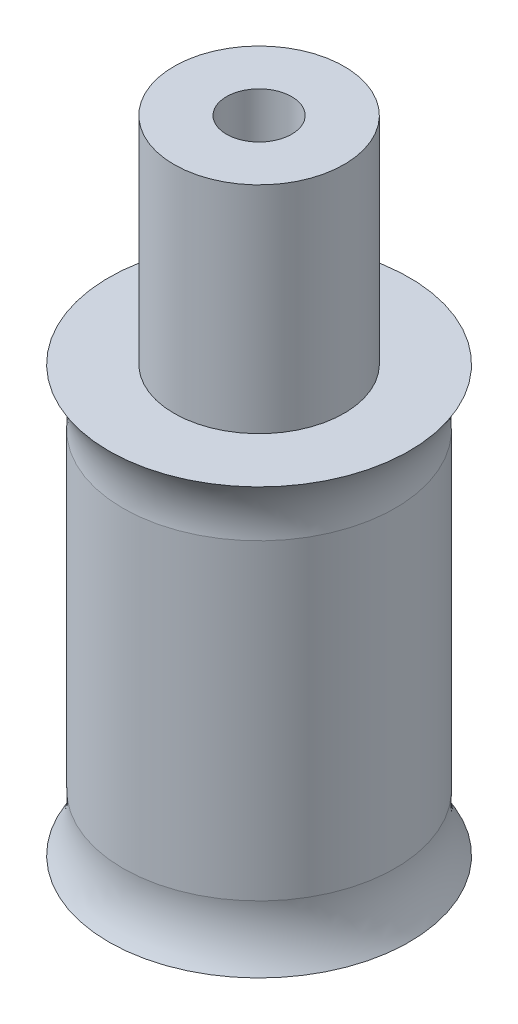
ISO-10303-21;
HEADER;
FILE_DESCRIPTION(('STEP AP214'),'2;1');
FILE_NAME('part.step','',(''),(''),'','','');
FILE_SCHEMA(('AUTOMOTIVE_DESIGN { 1 0 10303 214 1 1 1 1 }'));
ENDSEC;
DATA;
#1=APPLICATION_CONTEXT('core data for automotive mechanical design processes');
#2=APPLICATION_PROTOCOL_DEFINITION('international standard','automotive_design',2000,#1);
#3=PRODUCT_CONTEXT('',#1,'mechanical');
#4=PRODUCT('Part','Part','',(#3));
#5=PRODUCT_RELATED_PRODUCT_CATEGORY('part','',(#4));
#6=PRODUCT_DEFINITION_FORMATION('','',#4);
#7=PRODUCT_DEFINITION_CONTEXT('part definition',#1,'design');
#8=PRODUCT_DEFINITION('design','',#6,#7);
#9=PRODUCT_DEFINITION_SHAPE('','',#8);
#10=(LENGTH_UNIT() NAMED_UNIT(*) SI_UNIT(.MILLI.,.METRE.));
#11=(NAMED_UNIT(*) PLANE_ANGLE_UNIT() SI_UNIT($,.RADIAN.));
#12=(NAMED_UNIT(*) SI_UNIT($,.STERADIAN.) SOLID_ANGLE_UNIT());
#13=UNCERTAINTY_MEASURE_WITH_UNIT(LENGTH_MEASURE(1.E-05),#10,'distance_accuracy_value','');
#14=(GEOMETRIC_REPRESENTATION_CONTEXT(3) GLOBAL_UNCERTAINTY_ASSIGNED_CONTEXT((#13)) GLOBAL_UNIT_ASSIGNED_CONTEXT((#10,
#11,#12)) REPRESENTATION_CONTEXT('',''));
#15=CARTESIAN_POINT('',(0.,0.,0.));
#16=DIRECTION('',(0.,0.,1.));
#17=DIRECTION('',(1.,0.,0.));
#18=AXIS2_PLACEMENT_3D('',#15,#16,#17);
#19=CARTESIAN_POINT('',(0.,55.,0.));
#20=DIRECTION('',(0.,1.,0.));
#21=DIRECTION('',(0.,0.,1.));
#22=AXIS2_PLACEMENT_3D('',#19,#20,#21);
#23=CYLINDRICAL_SURFACE('',#22,4.8);
#24=CARTESIAN_POINT('',(0.,13.,0.));
#25=DIRECTION('',(0.,1.,0.));
#26=DIRECTION('',(0.,0.,1.));
#27=AXIS2_PLACEMENT_3D('',#24,#25,#26);
#28=CIRCLE('',#27,4.8);
#29=CARTESIAN_POINT('',(0.,13.,4.8));
#30=VERTEX_POINT('',#29);
#31=EDGE_CURVE('E146',#30,#30,#28,.T.);
#32=ORIENTED_EDGE('',*,*,#31,.F.);
#33=EDGE_LOOP('',(#32));
#34=FACE_BOUND('',#33,.T.);
#35=CARTESIAN_POINT('',(0.,2.,0.));
#36=DIRECTION('',(0.,1.,0.));
#37=DIRECTION('',(0.,0.,1.));
#38=AXIS2_PLACEMENT_3D('',#35,#36,#37);
#39=CIRCLE('',#38,4.8);
#40=CARTESIAN_POINT('',(0.,2.,4.8));
#41=VERTEX_POINT('',#40);
#42=EDGE_CURVE('E140',#41,#41,#39,.T.);
#43=ORIENTED_EDGE('',*,*,#42,.T.);
#44=EDGE_LOOP('',(#43));
#45=FACE_BOUND('',#44,.T.);
#46=ADVANCED_FACE('F38',(#34,#45),#23,.T.);
#47=CARTESIAN_POINT('',(3.,22.6,0.));
#48=DIRECTION('',(0.,-1.,0.));
#49=DIRECTION('',(0.,0.,-1.));
#50=AXIS2_PLACEMENT_3D('',#47,#48,#49);
#51=PLANE('',#50);
#52=CARTESIAN_POINT('',(0.,22.6,0.));
#53=DIRECTION('',(0.,1.,0.));
#54=DIRECTION('',(0.,0.,1.));
#55=AXIS2_PLACEMENT_3D('',#52,#53,#54);
#56=CIRCLE('',#55,3.);
#57=CARTESIAN_POINT('',(0.,22.6,3.));
#58=VERTEX_POINT('',#57);
#59=EDGE_CURVE('E12',#58,#58,#56,.T.);
#60=ORIENTED_EDGE('',*,*,#59,.T.);
#61=EDGE_LOOP('',(#60));
#62=FACE_BOUND('',#61,.T.);
#63=CARTESIAN_POINT('',(0.,22.6,0.));
#64=DIRECTION('',(0.,-1.,0.));
#65=DIRECTION('',(0.,0.,-1.));
#66=AXIS2_PLACEMENT_3D('',#63,#64,#65);
#67=CIRCLE('',#66,1.15);
#68=CARTESIAN_POINT('',(0.,22.6,-1.15));
#69=VERTEX_POINT('',#68);
#70=EDGE_CURVE('E149',#69,#69,#67,.T.);
#71=ORIENTED_EDGE('',*,*,#70,.T.);
#72=EDGE_LOOP('',(#71));
#73=FACE_BOUND('',#72,.T.);
#74=ADVANCED_FACE('F181',(#62,#73),#51,.F.);
#75=CARTESIAN_POINT('',(0.,55.,0.));
#76=DIRECTION('',(0.,1.,0.));
#77=DIRECTION('',(0.,0.,1.));
#78=AXIS2_PLACEMENT_3D('',#75,#76,#77);
#79=CYLINDRICAL_SURFACE('',#78,3.);
#80=ORIENTED_EDGE('',*,*,#59,.F.);
#81=EDGE_LOOP('',(#80));
#82=FACE_BOUND('',#81,.T.);
#83=CARTESIAN_POINT('',(0.,15.,0.));
#84=DIRECTION('',(0.,1.,0.));
#85=DIRECTION('',(0.,0.,1.));
#86=AXIS2_PLACEMENT_3D('',#83,#84,#85);
#87=CIRCLE('',#86,3.);
#88=CARTESIAN_POINT('',(0.,15.,3.));
#89=VERTEX_POINT('',#88);
#90=EDGE_CURVE('E46',#89,#89,#87,.T.);
#91=ORIENTED_EDGE('',*,*,#90,.T.);
#92=EDGE_LOOP('',(#91));
#93=FACE_BOUND('',#92,.T.);
#94=ADVANCED_FACE('F40',(#82,#93),#79,.T.);
#95=CARTESIAN_POINT('',(4.8,15.,0.));
#96=DIRECTION('',(0.,-1.,0.));
#97=DIRECTION('',(0.,0.,-1.));
#98=AXIS2_PLACEMENT_3D('',#95,#96,#97);
#99=PLANE('',#98);
#100=ORIENTED_EDGE('',*,*,#90,.F.);
#101=EDGE_LOOP('',(#100));
#102=FACE_BOUND('',#101,.T.);
#103=CARTESIAN_POINT('',(0.,15.,0.));
#104=DIRECTION('',(0.,1.,0.));
#105=DIRECTION('',(0.,0.,1.));
#106=AXIS2_PLACEMENT_3D('',#103,#104,#105);
#107=CIRCLE('',#106,5.3);
#108=CARTESIAN_POINT('',(0.,15.,5.3));
#109=VERTEX_POINT('',#108);
#110=EDGE_CURVE('E143',#109,#109,#107,.T.);
#111=ORIENTED_EDGE('',*,*,#110,.T.);
#112=EDGE_LOOP('',(#111));
#113=FACE_BOUND('',#112,.T.);
#114=ADVANCED_FACE('F158',(#102,#113),#99,.F.);
#115=CARTESIAN_POINT('',(0.,14.8,0.));
#116=DIRECTION('',(0.,1.,0.));
#117=DIRECTION('',(0.,0.,1.));
#118=AXIS2_PLACEMENT_3D('',#115,#116,#117);
#119=CYLINDRICAL_SURFACE('',#118,1.15);
#120=CARTESIAN_POINT('',(0.,14.8,0.));
#121=DIRECTION('',(0.,-1.,0.));
#122=DIRECTION('',(0.,0.,-1.));
#123=AXIS2_PLACEMENT_3D('',#120,#121,#122);
#124=CIRCLE('',#123,1.15);
#125=CARTESIAN_POINT('',(0.,14.8,-1.15));
#126=VERTEX_POINT('',#125);
#127=EDGE_CURVE('E150',#126,#126,#124,.T.);
#128=ORIENTED_EDGE('',*,*,#127,.T.);
#129=EDGE_LOOP('',(#128));
#130=FACE_BOUND('',#129,.T.);
#131=ORIENTED_EDGE('',*,*,#70,.F.);
#132=EDGE_LOOP('',(#131));
#133=FACE_BOUND('',#132,.T.);
#134=ADVANCED_FACE('F161',(#130,#133),#119,.F.);
#135=CARTESIAN_POINT('',(0.,14.8,0.));
#136=DIRECTION('',(0.,-1.,0.));
#137=DIRECTION('',(0.,0.,-1.));
#138=AXIS2_PLACEMENT_3D('',#135,#136,#137);
#139=PLANE('',#138);
#140=ORIENTED_EDGE('',*,*,#127,.F.);
#141=EDGE_LOOP('',(#140));
#142=FACE_BOUND('',#141,.T.);
#143=ADVANCED_FACE('F168',(#142),#139,.F.);
#144=CARTESIAN_POINT('',(0.,13.3166905790889,0.));
#145=DIRECTION('',(0.,1.,0.));
#146=DIRECTION('',(0.,0.,1.));
#147=AXIS2_PLACEMENT_3D('',#144,#145,#146);
#148=TOROIDAL_SURFACE('',#147,7.78323768364446,3.);
#149=ORIENTED_EDGE('',*,*,#31,.T.);
#150=EDGE_LOOP('',(#149));
#151=FACE_BOUND('',#150,.T.);
#152=ORIENTED_EDGE('',*,*,#110,.F.);
#153=EDGE_LOOP('',(#152));
#154=FACE_BOUND('',#153,.T.);
#155=ADVANCED_FACE('F165',(#151,#154),#148,.F.);
#156=CARTESIAN_POINT('',(0.,1.68330942091111,0.));
#157=DIRECTION('',(0.,-1.,0.));
#158=DIRECTION('',(0.,0.,1.));
#159=AXIS2_PLACEMENT_3D('',#156,#157,#158);
#160=TOROIDAL_SURFACE('',#159,7.78323768364446,3.);
#161=ORIENTED_EDGE('',*,*,#42,.F.);
#162=EDGE_LOOP('',(#161));
#163=FACE_BOUND('',#162,.T.);
#164=CARTESIAN_POINT('',(0.,0.,0.));
#165=DIRECTION('',(0.,1.,0.));
#166=DIRECTION('',(0.,0.,1.));
#167=AXIS2_PLACEMENT_3D('',#164,#165,#166);
#168=CIRCLE('',#167,5.3);
#169=CARTESIAN_POINT('',(0.,0.,5.3));
#170=VERTEX_POINT('',#169);
#171=EDGE_CURVE('E135',#170,#170,#168,.T.);
#172=ORIENTED_EDGE('',*,*,#171,.T.);
#173=EDGE_LOOP('',(#172));
#174=FACE_BOUND('',#173,.T.);
#175=ADVANCED_FACE('F167',(#163,#174),#160,.F.);
#176=CARTESIAN_POINT('',(4.8,0.,0.));
#177=DIRECTION('',(0.,1.,0.));
#178=DIRECTION('',(0.,0.,1.));
#179=AXIS2_PLACEMENT_3D('',#176,#177,#178);
#180=PLANE('',#179);
#181=DIRECTION('',(1.,0.,0.));
#182=VECTOR('',#181,1.);
#183=CARTESIAN_POINT('',(-0.4,0.,2.4));
#184=LINE('',#183,#182);
#185=CARTESIAN_POINT('',(-0.4,0.,2.4));
#186=VERTEX_POINT('',#185);
#187=CARTESIAN_POINT('',(0.4,0.,2.4));
#188=VERTEX_POINT('',#187);
#189=EDGE_CURVE('E119',#186,#188,#184,.T.);
#190=ORIENTED_EDGE('',*,*,#189,.F.);
#191=DIRECTION('',(0.,0.,-1.));
#192=VECTOR('',#191,1.);
#193=CARTESIAN_POINT('',(-0.4,0.,2.4));
#194=LINE('',#193,#192);
#195=CARTESIAN_POINT('',(-0.4,0.,3.2));
#196=VERTEX_POINT('',#195);
#197=EDGE_CURVE('E53',#196,#186,#194,.T.);
#198=ORIENTED_EDGE('',*,*,#197,.F.);
#199=DIRECTION('',(-0.447213595499958,0.,-0.894427190999916));
#200=VECTOR('',#199,1.);
#201=CARTESIAN_POINT('',(-0.4,0.,3.2));
#202=LINE('',#201,#200);
#203=CARTESIAN_POINT('',(0.,0.,4.));
#204=VERTEX_POINT('',#203);
#205=EDGE_CURVE('E125',#204,#196,#202,.T.);
#206=ORIENTED_EDGE('',*,*,#205,.F.);
#207=DIRECTION('',(-0.447213595499957,0.,0.894427190999916));
#208=VECTOR('',#207,1.);
#209=CARTESIAN_POINT('',(0.,0.,4.));
#210=LINE('',#209,#208);
#211=CARTESIAN_POINT('',(0.4,0.,3.2));
#212=VERTEX_POINT('',#211);
#213=EDGE_CURVE('E123',#212,#204,#210,.T.);
#214=ORIENTED_EDGE('',*,*,#213,.F.);
#215=DIRECTION('',(0.,0.,1.));
#216=VECTOR('',#215,1.);
#217=CARTESIAN_POINT('',(0.4,0.,2.4));
#218=LINE('',#217,#216);
#219=EDGE_CURVE('E95',#188,#212,#218,.T.);
#220=ORIENTED_EDGE('',*,*,#219,.F.);
#221=EDGE_LOOP('',(#190,#198,#206,#214,#220));
#222=FACE_BOUND('',#221,.T.);
#223=CARTESIAN_POINT('',(0.,0.,0.));
#224=DIRECTION('',(0.,-1.,0.));
#225=DIRECTION('',(0.,0.,-1.));
#226=AXIS2_PLACEMENT_3D('',#223,#224,#225);
#227=CIRCLE('',#226,2.);
#228=CARTESIAN_POINT('',(0.,0.,-2.));
#229=VERTEX_POINT('',#228);
#230=EDGE_CURVE('E128',#229,#229,#227,.T.);
#231=ORIENTED_EDGE('',*,*,#230,.F.);
#232=EDGE_LOOP('',(#231));
#233=FACE_BOUND('',#232,.T.);
#234=ORIENTED_EDGE('',*,*,#171,.F.);
#235=EDGE_LOOP('',(#234));
#236=FACE_BOUND('',#235,.T.);
#237=ADVANCED_FACE('F175',(#222,#233,#236),#180,.F.);
#238=CARTESIAN_POINT('',(0.,2.6,0.));
#239=DIRECTION('',(0.,-1.,0.));
#240=DIRECTION('',(0.,0.,-1.));
#241=AXIS2_PLACEMENT_3D('',#238,#239,#240);
#242=CYLINDRICAL_SURFACE('',#241,2.);
#243=CARTESIAN_POINT('',(0.,2.6,0.));
#244=DIRECTION('',(0.,-1.,0.));
#245=DIRECTION('',(0.,0.,-1.));
#246=AXIS2_PLACEMENT_3D('',#243,#244,#245);
#247=CIRCLE('',#246,2.);
#248=CARTESIAN_POINT('',(0.,2.6,-2.));
#249=VERTEX_POINT('',#248);
#250=EDGE_CURVE('E132',#249,#249,#247,.T.);
#251=ORIENTED_EDGE('',*,*,#250,.F.);
#252=EDGE_LOOP('',(#251));
#253=FACE_BOUND('',#252,.T.);
#254=ORIENTED_EDGE('',*,*,#230,.T.);
#255=EDGE_LOOP('',(#254));
#256=FACE_BOUND('',#255,.T.);
#257=ADVANCED_FACE('F193',(#253,#256),#242,.F.);
#258=CARTESIAN_POINT('',(0.,2.6,0.));
#259=DIRECTION('',(0.,-1.,0.));
#260=DIRECTION('',(0.,0.,-1.));
#261=AXIS2_PLACEMENT_3D('',#258,#259,#260);
#262=PLANE('',#261);
#263=ORIENTED_EDGE('',*,*,#250,.T.);
#264=EDGE_LOOP('',(#263));
#265=FACE_BOUND('',#264,.T.);
#266=ADVANCED_FACE('F198',(#265),#262,.T.);
#267=CARTESIAN_POINT('',(-0.4,2.,2.4));
#268=DIRECTION('',(-1.,0.,0.));
#269=DIRECTION('',(0.,0.,1.));
#270=AXIS2_PLACEMENT_3D('',#267,#268,#269);
#271=PLANE('',#270);
#272=ORIENTED_EDGE('',*,*,#197,.T.);
#273=DIRECTION('',(0.,-1.,0.));
#274=VECTOR('',#273,1.);
#275=CARTESIAN_POINT('',(-0.4,2.,2.4));
#276=LINE('',#275,#274);
#277=CARTESIAN_POINT('',(-0.4,2.,2.4));
#278=VERTEX_POINT('',#277);
#279=EDGE_CURVE('E80',#278,#186,#276,.T.);
#280=ORIENTED_EDGE('',*,*,#279,.F.);
#281=DIRECTION('',(0.,0.,-1.));
#282=VECTOR('',#281,1.);
#283=CARTESIAN_POINT('',(-0.4,2.,2.4));
#284=LINE('',#283,#282);
#285=CARTESIAN_POINT('',(-0.4,2.,3.2));
#286=VERTEX_POINT('',#285);
#287=EDGE_CURVE('E113',#286,#278,#284,.T.);
#288=ORIENTED_EDGE('',*,*,#287,.F.);
#289=DIRECTION('',(0.,-1.,0.));
#290=VECTOR('',#289,1.);
#291=CARTESIAN_POINT('',(-0.4,2.,3.2));
#292=LINE('',#291,#290);
#293=EDGE_CURVE('E61',#286,#196,#292,.T.);
#294=ORIENTED_EDGE('',*,*,#293,.T.);
#295=EDGE_LOOP('',(#272,#280,#288,#294));
#296=FACE_BOUND('',#295,.T.);
#297=ADVANCED_FACE('F211',(#296),#271,.F.);
#298=CARTESIAN_POINT('',(-0.4,2.,3.2));
#299=DIRECTION('',(-0.894427190999916,0.,0.447213595499958));
#300=DIRECTION('',(0.447213595499958,0.,0.894427190999916));
#301=AXIS2_PLACEMENT_3D('',#298,#299,#300);
#302=PLANE('',#301);
#303=ORIENTED_EDGE('',*,*,#205,.T.);
#304=ORIENTED_EDGE('',*,*,#293,.F.);
#305=DIRECTION('',(-0.447213595499958,0.,-0.894427190999916));
#306=VECTOR('',#305,1.);
#307=CARTESIAN_POINT('',(-0.4,2.,3.2));
#308=LINE('',#307,#306);
#309=CARTESIAN_POINT('',(0.,2.,4.));
#310=VERTEX_POINT('',#309);
#311=EDGE_CURVE('E107',#310,#286,#308,.T.);
#312=ORIENTED_EDGE('',*,*,#311,.F.);
#313=DIRECTION('',(0.,-1.,0.));
#314=VECTOR('',#313,1.);
#315=CARTESIAN_POINT('',(0.,2.,4.));
#316=LINE('',#315,#314);
#317=EDGE_CURVE('E99',#310,#204,#316,.T.);
#318=ORIENTED_EDGE('',*,*,#317,.T.);
#319=EDGE_LOOP('',(#303,#304,#312,#318));
#320=FACE_BOUND('',#319,.T.);
#321=ADVANCED_FACE('F213',(#320),#302,.F.);
#322=CARTESIAN_POINT('',(0.,2.,4.));
#323=DIRECTION('',(0.894427190999916,0.,0.447213595499957));
#324=DIRECTION('',(0.447213595499957,0.,-0.894427190999916));
#325=AXIS2_PLACEMENT_3D('',#322,#323,#324);
#326=PLANE('',#325);
#327=ORIENTED_EDGE('',*,*,#213,.T.);
#328=ORIENTED_EDGE('',*,*,#317,.F.);
#329=DIRECTION('',(-0.447213595499957,0.,0.894427190999916));
#330=VECTOR('',#329,1.);
#331=CARTESIAN_POINT('',(0.,2.,4.));
#332=LINE('',#331,#330);
#333=CARTESIAN_POINT('',(0.4,2.,3.2));
#334=VERTEX_POINT('',#333);
#335=EDGE_CURVE('E103',#334,#310,#332,.T.);
#336=ORIENTED_EDGE('',*,*,#335,.F.);
#337=DIRECTION('',(0.,-1.,0.));
#338=VECTOR('',#337,1.);
#339=CARTESIAN_POINT('',(0.4,2.,3.2));
#340=LINE('',#339,#338);
#341=EDGE_CURVE('E88',#334,#212,#340,.T.);
#342=ORIENTED_EDGE('',*,*,#341,.T.);
#343=EDGE_LOOP('',(#327,#328,#336,#342));
#344=FACE_BOUND('',#343,.T.);
#345=ADVANCED_FACE('F104',(#344),#326,.F.);
#346=CARTESIAN_POINT('',(0.4,2.,2.4));
#347=DIRECTION('',(1.,0.,0.));
#348=DIRECTION('',(0.,0.,-1.));
#349=AXIS2_PLACEMENT_3D('',#346,#347,#348);
#350=PLANE('',#349);
#351=ORIENTED_EDGE('',*,*,#219,.T.);
#352=ORIENTED_EDGE('',*,*,#341,.F.);
#353=DIRECTION('',(0.,0.,1.));
#354=VECTOR('',#353,1.);
#355=CARTESIAN_POINT('',(0.4,2.,2.4));
#356=LINE('',#355,#354);
#357=CARTESIAN_POINT('',(0.4,2.,2.4));
#358=VERTEX_POINT('',#357);
#359=EDGE_CURVE('E92',#358,#334,#356,.T.);
#360=ORIENTED_EDGE('',*,*,#359,.F.);
#361=DIRECTION('',(0.,-1.,0.));
#362=VECTOR('',#361,1.);
#363=CARTESIAN_POINT('',(0.4,2.,2.4));
#364=LINE('',#363,#362);
#365=EDGE_CURVE('E100',#358,#188,#364,.T.);
#366=ORIENTED_EDGE('',*,*,#365,.T.);
#367=EDGE_LOOP('',(#351,#352,#360,#366));
#368=FACE_BOUND('',#367,.T.);
#369=ADVANCED_FACE('F90',(#368),#350,.F.);
#370=CARTESIAN_POINT('',(-0.4,2.,2.4));
#371=DIRECTION('',(0.,0.,-1.));
#372=DIRECTION('',(-1.,0.,0.));
#373=AXIS2_PLACEMENT_3D('',#370,#371,#372);
#374=PLANE('',#373);
#375=ORIENTED_EDGE('',*,*,#189,.T.);
#376=ORIENTED_EDGE('',*,*,#365,.F.);
#377=DIRECTION('',(1.,0.,0.));
#378=VECTOR('',#377,1.);
#379=CARTESIAN_POINT('',(-0.4,2.,2.4));
#380=LINE('',#379,#378);
#381=EDGE_CURVE('E111',#278,#358,#380,.T.);
#382=ORIENTED_EDGE('',*,*,#381,.F.);
#383=ORIENTED_EDGE('',*,*,#279,.T.);
#384=EDGE_LOOP('',(#375,#376,#382,#383));
#385=FACE_BOUND('',#384,.T.);
#386=ADVANCED_FACE('F210',(#385),#374,.F.);
#387=CARTESIAN_POINT('',(0.,2.,0.));
#388=DIRECTION('',(0.,1.,0.));
#389=DIRECTION('',(0.,0.,1.));
#390=AXIS2_PLACEMENT_3D('',#387,#388,#389);
#391=PLANE('',#390);
#392=ORIENTED_EDGE('',*,*,#287,.T.);
#393=ORIENTED_EDGE('',*,*,#381,.T.);
#394=ORIENTED_EDGE('',*,*,#359,.T.);
#395=ORIENTED_EDGE('',*,*,#335,.T.);
#396=ORIENTED_EDGE('',*,*,#311,.T.);
#397=EDGE_LOOP('',(#392,#393,#394,#395,#396));
#398=FACE_BOUND('',#397,.T.);
#399=ADVANCED_FACE('F110',(#398),#391,.F.);
#400=CLOSED_SHELL('',(#46,#74,#94,#114,#134,#143,#155,#175,#237,#257,#266,#297,#321,#345,#369,
#386,#399));
#401=MANIFOLD_SOLID_BREP('B2',#400);
#402=ADVANCED_BREP_SHAPE_REPRESENTATION('',(#18,#401),#14);
#403=SHAPE_DEFINITION_REPRESENTATION(#9,#402);
ENDSEC;
END-ISO-10303-21;
